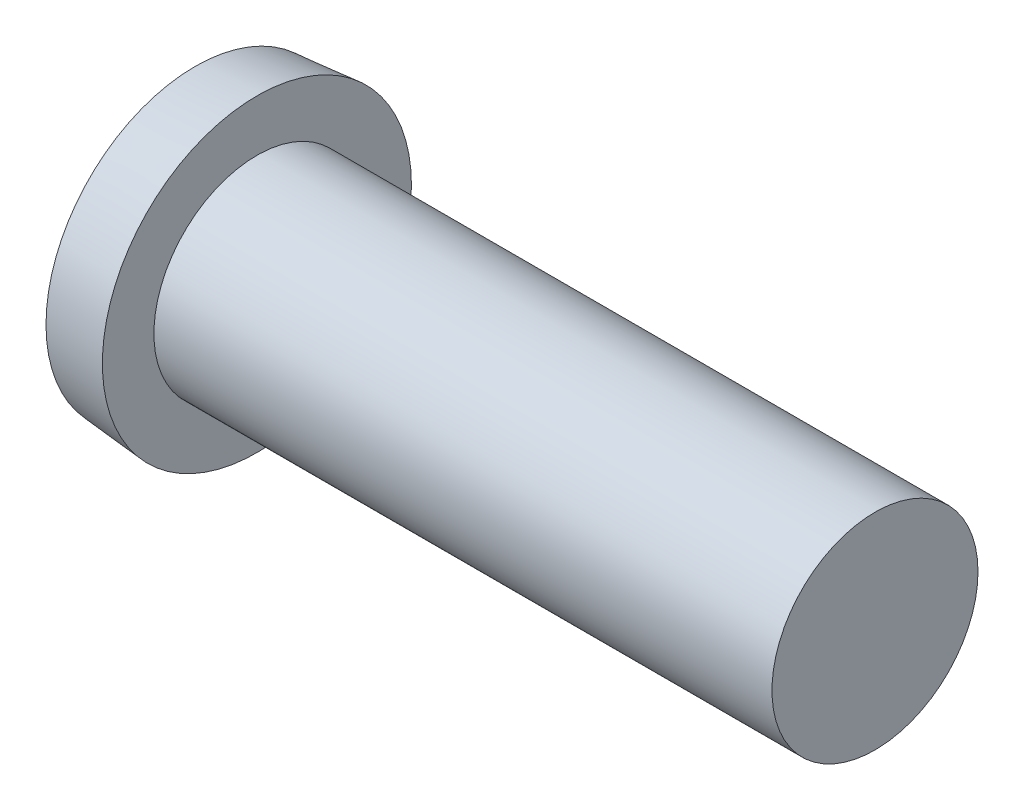
ISO-10303-21;
HEADER;
FILE_DESCRIPTION(('STEP AP214'),'2;1');
FILE_NAME('part.step','',(''),(''),'','','');
FILE_SCHEMA(('AUTOMOTIVE_DESIGN { 1 0 10303 214 1 1 1 1 }'));
ENDSEC;
DATA;
#1=APPLICATION_CONTEXT('core data for automotive mechanical design processes');
#2=APPLICATION_PROTOCOL_DEFINITION('international standard','automotive_design',2000,#1);
#3=PRODUCT_CONTEXT('',#1,'mechanical');
#4=PRODUCT('Part','Part','',(#3));
#5=PRODUCT_RELATED_PRODUCT_CATEGORY('part','',(#4));
#6=PRODUCT_DEFINITION_FORMATION('','',#4);
#7=PRODUCT_DEFINITION_CONTEXT('part definition',#1,'design');
#8=PRODUCT_DEFINITION('design','',#6,#7);
#9=PRODUCT_DEFINITION_SHAPE('','',#8);
#10=(LENGTH_UNIT() NAMED_UNIT(*) SI_UNIT(.MILLI.,.METRE.));
#11=(NAMED_UNIT(*) PLANE_ANGLE_UNIT() SI_UNIT($,.RADIAN.));
#12=(NAMED_UNIT(*) SI_UNIT($,.STERADIAN.) SOLID_ANGLE_UNIT());
#13=UNCERTAINTY_MEASURE_WITH_UNIT(LENGTH_MEASURE(1.E-05),#10,'distance_accuracy_value','');
#14=(GEOMETRIC_REPRESENTATION_CONTEXT(3) GLOBAL_UNCERTAINTY_ASSIGNED_CONTEXT((#13)) GLOBAL_UNIT_ASSIGNED_CONTEXT((#10,
#11,#12)) REPRESENTATION_CONTEXT('',''));
#15=CARTESIAN_POINT('',(0.,0.,0.));
#16=DIRECTION('',(0.,0.,1.));
#17=DIRECTION('',(1.,0.,0.));
#18=AXIS2_PLACEMENT_3D('',#15,#16,#17);
#19=CARTESIAN_POINT('',(-0.3,0.,0.));
#20=DIRECTION('',(-1.,0.,0.));
#21=DIRECTION('',(0.,0.,1.));
#22=AXIS2_PLACEMENT_3D('',#19,#20,#21);
#23=PLANE('',#22);
#24=CARTESIAN_POINT('',(-0.3,0.,0.));
#25=DIRECTION('',(-1.,0.,0.));
#26=DIRECTION('',(0.,0.,1.));
#27=AXIS2_PLACEMENT_3D('',#24,#25,#26);
#28=CIRCLE('',#27,1.0000000000332);
#29=CARTESIAN_POINT('',(-0.3,-0.300000000000698,0.953939201451525));
#30=VERTEX_POINT('',#29);
#31=CARTESIAN_POINT('',(-0.3,0.3,0.953939201451589));
#32=VERTEX_POINT('',#31);
#33=EDGE_CURVE('E137',#30,#32,#28,.T.);
#34=ORIENTED_EDGE('',*,*,#33,.T.);
#35=DIRECTION('',(0.,0.,-1.));
#36=VECTOR('',#35,1.);
#37=CARTESIAN_POINT('',(-0.3,0.3,0.));
#38=LINE('',#37,#36);
#39=CARTESIAN_POINT('',(-0.3,0.3,0.3));
#40=VERTEX_POINT('',#39);
#41=EDGE_CURVE('E117',#40,#32,#38,.F.);
#42=ORIENTED_EDGE('',*,*,#41,.F.);
#43=DIRECTION('',(0.,1.,0.));
#44=VECTOR('',#43,1.);
#45=CARTESIAN_POINT('',(-0.3,0.,0.3));
#46=LINE('',#45,#44);
#47=CARTESIAN_POINT('',(-0.3,0.953939201451357,0.3));
#48=VERTEX_POINT('',#47);
#49=EDGE_CURVE('E115',#48,#40,#46,.F.);
#50=ORIENTED_EDGE('',*,*,#49,.F.);
#51=CARTESIAN_POINT('',(-0.3,0.,0.));
#52=DIRECTION('',(-1.,0.,0.));
#53=DIRECTION('',(0.,0.,1.));
#54=AXIS2_PLACEMENT_3D('',#51,#52,#53);
#55=CIRCLE('',#54,1.0000000000332);
#56=CARTESIAN_POINT('',(-0.3,0.953939201451569,-0.3));
#57=VERTEX_POINT('',#56);
#58=EDGE_CURVE('E20',#48,#57,#55,.T.);
#59=ORIENTED_EDGE('',*,*,#58,.T.);
#60=DIRECTION('',(0.,1.,0.));
#61=VECTOR('',#60,1.);
#62=CARTESIAN_POINT('',(-0.3,0.,-0.3));
#63=LINE('',#62,#61);
#64=CARTESIAN_POINT('',(-0.3,0.3,-0.3));
#65=VERTEX_POINT('',#64);
#66=EDGE_CURVE('E113',#65,#57,#63,.T.);
#67=ORIENTED_EDGE('',*,*,#66,.F.);
#68=DIRECTION('',(0.,0.,-1.));
#69=VECTOR('',#68,1.);
#70=CARTESIAN_POINT('',(-0.3,0.3,0.));
#71=LINE('',#70,#69);
#72=CARTESIAN_POINT('',(-0.3,0.300000000001235,-0.953939201451357));
#73=VERTEX_POINT('',#72);
#74=EDGE_CURVE('E165',#73,#65,#71,.F.);
#75=ORIENTED_EDGE('',*,*,#74,.F.);
#76=CARTESIAN_POINT('',(-0.3,0.,0.));
#77=DIRECTION('',(-1.,0.,0.));
#78=DIRECTION('',(0.,0.,1.));
#79=AXIS2_PLACEMENT_3D('',#76,#77,#78);
#80=CIRCLE('',#79,1.0000000000332);
#81=CARTESIAN_POINT('',(-0.3,-0.3,-0.953939201451526));
#82=VERTEX_POINT('',#81);
#83=EDGE_CURVE('E161',#73,#82,#80,.T.);
#84=ORIENTED_EDGE('',*,*,#83,.T.);
#85=DIRECTION('',(0.,0.,1.));
#86=VECTOR('',#85,1.);
#87=CARTESIAN_POINT('',(-0.3,-0.3,0.));
#88=LINE('',#87,#86);
#89=CARTESIAN_POINT('',(-0.3,-0.3,-0.3));
#90=VERTEX_POINT('',#89);
#91=EDGE_CURVE('E157',#90,#82,#88,.F.);
#92=ORIENTED_EDGE('',*,*,#91,.F.);
#93=DIRECTION('',(0.,1.,0.));
#94=VECTOR('',#93,1.);
#95=CARTESIAN_POINT('',(-0.3,0.,-0.3));
#96=LINE('',#95,#94);
#97=CARTESIAN_POINT('',(-0.3,-0.953939201451526,-0.300000000000698));
#98=VERTEX_POINT('',#97);
#99=EDGE_CURVE('E153',#98,#90,#96,.T.);
#100=ORIENTED_EDGE('',*,*,#99,.F.);
#101=CARTESIAN_POINT('',(-0.3,0.,0.));
#102=DIRECTION('',(-1.,0.,0.));
#103=DIRECTION('',(0.,0.,1.));
#104=AXIS2_PLACEMENT_3D('',#101,#102,#103);
#105=CIRCLE('',#104,1.0000000000332);
#106=CARTESIAN_POINT('',(-0.3,-0.953939201451525,0.3));
#107=VERTEX_POINT('',#106);
#108=EDGE_CURVE('E149',#98,#107,#105,.T.);
#109=ORIENTED_EDGE('',*,*,#108,.T.);
#110=DIRECTION('',(0.,1.,0.));
#111=VECTOR('',#110,1.);
#112=CARTESIAN_POINT('',(-0.3,0.,0.3));
#113=LINE('',#112,#111);
#114=CARTESIAN_POINT('',(-0.3,-0.3,0.3));
#115=VERTEX_POINT('',#114);
#116=EDGE_CURVE('E145',#115,#107,#113,.F.);
#117=ORIENTED_EDGE('',*,*,#116,.F.);
#118=DIRECTION('',(0.,0.,1.));
#119=VECTOR('',#118,1.);
#120=CARTESIAN_POINT('',(-0.3,-0.3,0.));
#121=LINE('',#120,#119);
#122=EDGE_CURVE('E141',#30,#115,#121,.F.);
#123=ORIENTED_EDGE('',*,*,#122,.F.);
#124=EDGE_LOOP('',(#34,#42,#50,#59,#67,#75,#84,#92,#100,#109,#117,#123));
#125=FACE_BOUND('',#124,.T.);
#126=ADVANCED_FACE('F17',(#125),#23,.T.);
#127=CARTESIAN_POINT('',(-0.3,0.,0.));
#128=DIRECTION('',(-1.,0.,0.));
#129=DIRECTION('',(0.,0.,1.));
#130=AXIS2_PLACEMENT_3D('',#127,#128,#129);
#131=CYLINDRICAL_SURFACE('',#130,1.0000000000332);
#132=DIRECTION('',(1.,0.,0.));
#133=VECTOR('',#132,1.);
#134=CARTESIAN_POINT('',(-0.3,0.953939201451393,-0.3));
#135=LINE('',#134,#133);
#136=CARTESIAN_POINT('',(-0.6,0.953939201451393,-0.30000000000056));
#137=VERTEX_POINT('',#136);
#138=EDGE_CURVE('E110',#57,#137,#135,.F.);
#139=ORIENTED_EDGE('',*,*,#138,.F.);
#140=ORIENTED_EDGE('',*,*,#58,.F.);
#141=DIRECTION('',(-1.,0.,0.));
#142=VECTOR('',#141,1.);
#143=CARTESIAN_POINT('',(-0.3,0.953939201450969,0.3));
#144=LINE('',#143,#142);
#145=CARTESIAN_POINT('',(-0.6,0.953939201451357,0.3));
#146=VERTEX_POINT('',#145);
#147=EDGE_CURVE('E107',#146,#48,#144,.F.);
#148=ORIENTED_EDGE('',*,*,#147,.F.);
#149=CARTESIAN_POINT('',(-0.6,0.,0.));
#150=DIRECTION('',(-1.,0.,0.));
#151=DIRECTION('',(0.,0.,1.));
#152=AXIS2_PLACEMENT_3D('',#149,#150,#151);
#153=CIRCLE('',#152,1.0000000000332);
#154=EDGE_CURVE('E132',#146,#137,#153,.T.);
#155=ORIENTED_EDGE('',*,*,#154,.T.);
#156=EDGE_LOOP('',(#139,#140,#148,#155));
#157=FACE_BOUND('',#156,.T.);
#158=ADVANCED_FACE('F105',(#157),#131,.F.);
#159=CARTESIAN_POINT('',(-0.3,0.,-0.3));
#160=DIRECTION('',(0.,0.,1.));
#161=DIRECTION('',(1.,0.,0.));
#162=AXIS2_PLACEMENT_3D('',#159,#160,#161);
#163=PLANE('',#162);
#164=ORIENTED_EDGE('',*,*,#66,.T.);
#165=ORIENTED_EDGE('',*,*,#138,.T.);
#166=DIRECTION('',(0.,1.,0.));
#167=VECTOR('',#166,1.);
#168=CARTESIAN_POINT('',(-0.6,0.,-0.300000000001121));
#169=LINE('',#168,#167);
#170=CARTESIAN_POINT('',(-0.6,0.3,-0.300000000000747));
#171=VERTEX_POINT('',#170);
#172=EDGE_CURVE('E130',#137,#171,#169,.F.);
#173=ORIENTED_EDGE('',*,*,#172,.T.);
#174=DIRECTION('',(1.,0.,0.));
#175=VECTOR('',#174,1.);
#176=CARTESIAN_POINT('',(-0.3,0.3,-0.3));
#177=LINE('',#176,#175);
#178=EDGE_CURVE('E162',#65,#171,#177,.F.);
#179=ORIENTED_EDGE('',*,*,#178,.F.);
#180=EDGE_LOOP('',(#164,#165,#173,#179));
#181=FACE_BOUND('',#180,.T.);
#182=ADVANCED_FACE('F247',(#181),#163,.T.);
#183=CARTESIAN_POINT('',(-0.3,0.3,0.));
#184=DIRECTION('',(0.,-1.,0.));
#185=DIRECTION('',(0.,0.,-1.));
#186=AXIS2_PLACEMENT_3D('',#183,#184,#185);
#187=PLANE('',#186);
#188=ORIENTED_EDGE('',*,*,#74,.T.);
#189=ORIENTED_EDGE('',*,*,#178,.T.);
#190=DIRECTION('',(0.,0.,-1.));
#191=VECTOR('',#190,1.);
#192=CARTESIAN_POINT('',(-0.6,0.3,0.));
#193=LINE('',#192,#191);
#194=CARTESIAN_POINT('',(-0.6,0.300000000001235,-0.953939201451357));
#195=VERTEX_POINT('',#194);
#196=EDGE_CURVE('E197',#171,#195,#193,.T.);
#197=ORIENTED_EDGE('',*,*,#196,.T.);
#198=DIRECTION('',(-1.,0.,0.));
#199=VECTOR('',#198,1.);
#200=CARTESIAN_POINT('',(-0.3,0.300000000002469,-0.953939201450969));
#201=LINE('',#200,#199);
#202=EDGE_CURVE('E158',#195,#73,#201,.F.);
#203=ORIENTED_EDGE('',*,*,#202,.T.);
#204=EDGE_LOOP('',(#188,#189,#197,#203));
#205=FACE_BOUND('',#204,.T.);
#206=ADVANCED_FACE('F248',(#205),#187,.T.);
#207=CARTESIAN_POINT('',(-0.3,0.,0.));
#208=DIRECTION('',(-1.,0.,0.));
#209=DIRECTION('',(0.,0.,1.));
#210=AXIS2_PLACEMENT_3D('',#207,#208,#209);
#211=CYLINDRICAL_SURFACE('',#210,1.0000000000332);
#212=DIRECTION('',(1.,0.,0.));
#213=VECTOR('',#212,1.);
#214=CARTESIAN_POINT('',(-0.3,-0.3,-0.953939201451306));
#215=LINE('',#214,#213);
#216=CARTESIAN_POINT('',(-0.6,-0.300000000000698,-0.953939201451306));
#217=VERTEX_POINT('',#216);
#218=EDGE_CURVE('E154',#82,#217,#215,.F.);
#219=ORIENTED_EDGE('',*,*,#218,.F.);
#220=ORIENTED_EDGE('',*,*,#83,.F.);
#221=ORIENTED_EDGE('',*,*,#202,.F.);
#222=CARTESIAN_POINT('',(-0.6,0.,0.));
#223=DIRECTION('',(-1.,0.,0.));
#224=DIRECTION('',(0.,0.,1.));
#225=AXIS2_PLACEMENT_3D('',#222,#223,#224);
#226=CIRCLE('',#225,1.0000000000332);
#227=EDGE_CURVE('E194',#195,#217,#226,.T.);
#228=ORIENTED_EDGE('',*,*,#227,.T.);
#229=EDGE_LOOP('',(#219,#220,#221,#228));
#230=FACE_BOUND('',#229,.T.);
#231=ADVANCED_FACE('F205',(#230),#211,.F.);
#232=CARTESIAN_POINT('',(-0.3,-0.3,0.));
#233=DIRECTION('',(0.,1.,0.));
#234=DIRECTION('',(0.,0.,1.));
#235=AXIS2_PLACEMENT_3D('',#232,#233,#234);
#236=PLANE('',#235);
#237=ORIENTED_EDGE('',*,*,#91,.T.);
#238=ORIENTED_EDGE('',*,*,#218,.T.);
#239=DIRECTION('',(0.,0.,-1.));
#240=VECTOR('',#239,1.);
#241=CARTESIAN_POINT('',(-0.6,-0.300000000001397,0.));
#242=LINE('',#241,#240);
#243=CARTESIAN_POINT('',(-0.6,-0.300000000000931,-0.3));
#244=VERTEX_POINT('',#243);
#245=EDGE_CURVE('E196',#217,#244,#242,.F.);
#246=ORIENTED_EDGE('',*,*,#245,.T.);
#247=DIRECTION('',(1.,0.,0.));
#248=VECTOR('',#247,1.);
#249=CARTESIAN_POINT('',(-0.3,-0.3,-0.3));
#250=LINE('',#249,#248);
#251=EDGE_CURVE('E150',#90,#244,#250,.F.);
#252=ORIENTED_EDGE('',*,*,#251,.F.);
#253=EDGE_LOOP('',(#237,#238,#246,#252));
#254=FACE_BOUND('',#253,.T.);
#255=ADVANCED_FACE('F209',(#254),#236,.T.);
#256=CARTESIAN_POINT('',(-0.3,0.,-0.3));
#257=DIRECTION('',(0.,0.,1.));
#258=DIRECTION('',(1.,0.,0.));
#259=AXIS2_PLACEMENT_3D('',#256,#257,#258);
#260=PLANE('',#259);
#261=ORIENTED_EDGE('',*,*,#99,.T.);
#262=ORIENTED_EDGE('',*,*,#251,.T.);
#263=DIRECTION('',(0.,1.,0.));
#264=VECTOR('',#263,1.);
#265=CARTESIAN_POINT('',(-0.6,0.,-0.3));
#266=LINE('',#265,#264);
#267=CARTESIAN_POINT('',(-0.6,-0.953939201451526,-0.300000000000698));
#268=VERTEX_POINT('',#267);
#269=EDGE_CURVE('E193',#244,#268,#266,.F.);
#270=ORIENTED_EDGE('',*,*,#269,.T.);
#271=DIRECTION('',(-1.,0.,0.));
#272=VECTOR('',#271,1.);
#273=CARTESIAN_POINT('',(-0.3,-0.953939201451306,-0.300000000001397));
#274=LINE('',#273,#272);
#275=EDGE_CURVE('E146',#268,#98,#274,.F.);
#276=ORIENTED_EDGE('',*,*,#275,.T.);
#277=EDGE_LOOP('',(#261,#262,#270,#276));
#278=FACE_BOUND('',#277,.T.);
#279=ADVANCED_FACE('F212',(#278),#260,.T.);
#280=CARTESIAN_POINT('',(-0.3,0.,0.));
#281=DIRECTION('',(-1.,0.,0.));
#282=DIRECTION('',(0.,0.,1.));
#283=AXIS2_PLACEMENT_3D('',#280,#281,#282);
#284=CYLINDRICAL_SURFACE('',#283,1.0000000000332);
#285=DIRECTION('',(-1.,0.,0.));
#286=VECTOR('',#285,1.);
#287=CARTESIAN_POINT('',(-0.3,-0.953939201451306,0.3));
#288=LINE('',#287,#286);
#289=CARTESIAN_POINT('',(-0.6,-0.953939201451306,0.300000000000698));
#290=VERTEX_POINT('',#289);
#291=EDGE_CURVE('E142',#107,#290,#288,.T.);
#292=ORIENTED_EDGE('',*,*,#291,.F.);
#293=ORIENTED_EDGE('',*,*,#108,.F.);
#294=ORIENTED_EDGE('',*,*,#275,.F.);
#295=CARTESIAN_POINT('',(-0.6,0.,0.));
#296=DIRECTION('',(-1.,0.,0.));
#297=DIRECTION('',(0.,0.,1.));
#298=AXIS2_PLACEMENT_3D('',#295,#296,#297);
#299=CIRCLE('',#298,1.0000000000332);
#300=EDGE_CURVE('E190',#268,#290,#299,.T.);
#301=ORIENTED_EDGE('',*,*,#300,.T.);
#302=EDGE_LOOP('',(#292,#293,#294,#301));
#303=FACE_BOUND('',#302,.T.);
#304=ADVANCED_FACE('F219',(#303),#284,.F.);
#305=CARTESIAN_POINT('',(-0.3,0.,0.3));
#306=DIRECTION('',(0.,0.,-1.));
#307=DIRECTION('',(-1.,0.,0.));
#308=AXIS2_PLACEMENT_3D('',#305,#306,#307);
#309=PLANE('',#308);
#310=ORIENTED_EDGE('',*,*,#116,.T.);
#311=ORIENTED_EDGE('',*,*,#291,.T.);
#312=DIRECTION('',(0.,1.,0.));
#313=VECTOR('',#312,1.);
#314=CARTESIAN_POINT('',(-0.6,0.,0.300000000001397));
#315=LINE('',#314,#313);
#316=CARTESIAN_POINT('',(-0.6,-0.3,0.300000000000931));
#317=VERTEX_POINT('',#316);
#318=EDGE_CURVE('E192',#290,#317,#315,.T.);
#319=ORIENTED_EDGE('',*,*,#318,.T.);
#320=DIRECTION('',(1.,0.,0.));
#321=VECTOR('',#320,1.);
#322=CARTESIAN_POINT('',(-0.3,-0.3,0.3));
#323=LINE('',#322,#321);
#324=EDGE_CURVE('E138',#115,#317,#323,.F.);
#325=ORIENTED_EDGE('',*,*,#324,.F.);
#326=EDGE_LOOP('',(#310,#311,#319,#325));
#327=FACE_BOUND('',#326,.T.);
#328=ADVANCED_FACE('F223',(#327),#309,.T.);
#329=CARTESIAN_POINT('',(-0.3,-0.3,0.));
#330=DIRECTION('',(0.,1.,0.));
#331=DIRECTION('',(0.,0.,1.));
#332=AXIS2_PLACEMENT_3D('',#329,#330,#331);
#333=PLANE('',#332);
#334=ORIENTED_EDGE('',*,*,#122,.T.);
#335=ORIENTED_EDGE('',*,*,#324,.T.);
#336=DIRECTION('',(0.,0.,-1.));
#337=VECTOR('',#336,1.);
#338=CARTESIAN_POINT('',(-0.6,-0.3,0.));
#339=LINE('',#338,#337);
#340=CARTESIAN_POINT('',(-0.6,-0.300000000000698,0.953939201451525));
#341=VERTEX_POINT('',#340);
#342=EDGE_CURVE('E189',#317,#341,#339,.F.);
#343=ORIENTED_EDGE('',*,*,#342,.T.);
#344=DIRECTION('',(-1.,0.,0.));
#345=VECTOR('',#344,1.);
#346=CARTESIAN_POINT('',(-0.3,-0.300000000001397,0.953939201451306));
#347=LINE('',#346,#345);
#348=EDGE_CURVE('E134',#341,#30,#347,.F.);
#349=ORIENTED_EDGE('',*,*,#348,.T.);
#350=EDGE_LOOP('',(#334,#335,#343,#349));
#351=FACE_BOUND('',#350,.T.);
#352=ADVANCED_FACE('F227',(#351),#333,.T.);
#353=CARTESIAN_POINT('',(-0.3,0.,0.));
#354=DIRECTION('',(-1.,0.,0.));
#355=DIRECTION('',(0.,0.,1.));
#356=AXIS2_PLACEMENT_3D('',#353,#354,#355);
#357=CYLINDRICAL_SURFACE('',#356,1.0000000000332);
#358=ORIENTED_EDGE('',*,*,#33,.F.);
#359=ORIENTED_EDGE('',*,*,#348,.F.);
#360=CARTESIAN_POINT('',(-0.6,0.,0.));
#361=DIRECTION('',(-1.,0.,0.));
#362=DIRECTION('',(0.,0.,1.));
#363=AXIS2_PLACEMENT_3D('',#360,#361,#362);
#364=CIRCLE('',#363,1.0000000000332);
#365=CARTESIAN_POINT('',(-0.6,0.300000000000495,0.953939201451433));
#366=VERTEX_POINT('',#365);
#367=EDGE_CURVE('E187',#341,#366,#364,.T.);
#368=ORIENTED_EDGE('',*,*,#367,.T.);
#369=DIRECTION('',(1.,0.,0.));
#370=VECTOR('',#369,1.);
#371=CARTESIAN_POINT('',(-0.3,0.3,0.953939201451433));
#372=LINE('',#371,#370);
#373=EDGE_CURVE('E125',#32,#366,#372,.F.);
#374=ORIENTED_EDGE('',*,*,#373,.F.);
#375=EDGE_LOOP('',(#358,#359,#368,#374));
#376=FACE_BOUND('',#375,.T.);
#377=ADVANCED_FACE('F231',(#376),#357,.F.);
#378=CARTESIAN_POINT('',(-0.3,0.3,0.));
#379=DIRECTION('',(0.,-1.,0.));
#380=DIRECTION('',(0.,0.,-1.));
#381=AXIS2_PLACEMENT_3D('',#378,#379,#380);
#382=PLANE('',#381);
#383=ORIENTED_EDGE('',*,*,#41,.T.);
#384=ORIENTED_EDGE('',*,*,#373,.T.);
#385=DIRECTION('',(0.,0.,-1.));
#386=VECTOR('',#385,1.);
#387=CARTESIAN_POINT('',(-0.6,0.300000000000991,0.));
#388=LINE('',#387,#386);
#389=CARTESIAN_POINT('',(-0.6,0.300000000000661,0.3));
#390=VERTEX_POINT('',#389);
#391=EDGE_CURVE('E35',#366,#390,#388,.T.);
#392=ORIENTED_EDGE('',*,*,#391,.T.);
#393=DIRECTION('',(-1.,0.,0.));
#394=VECTOR('',#393,1.);
#395=CARTESIAN_POINT('',(-0.3,0.3,0.3));
#396=LINE('',#395,#394);
#397=EDGE_CURVE('E119',#40,#390,#396,.T.);
#398=ORIENTED_EDGE('',*,*,#397,.F.);
#399=EDGE_LOOP('',(#383,#384,#392,#398));
#400=FACE_BOUND('',#399,.T.);
#401=ADVANCED_FACE('F232',(#400),#382,.T.);
#402=CARTESIAN_POINT('',(-0.3,0.,0.3));
#403=DIRECTION('',(0.,0.,-1.));
#404=DIRECTION('',(-1.,0.,0.));
#405=AXIS2_PLACEMENT_3D('',#402,#403,#404);
#406=PLANE('',#405);
#407=ORIENTED_EDGE('',*,*,#49,.T.);
#408=ORIENTED_EDGE('',*,*,#397,.T.);
#409=DIRECTION('',(0.,1.,0.));
#410=VECTOR('',#409,1.);
#411=CARTESIAN_POINT('',(-0.6,0.,0.3));
#412=LINE('',#411,#410);
#413=EDGE_CURVE('E123',#390,#146,#412,.T.);
#414=ORIENTED_EDGE('',*,*,#413,.T.);
#415=ORIENTED_EDGE('',*,*,#147,.T.);
#416=EDGE_LOOP('',(#407,#408,#414,#415));
#417=FACE_BOUND('',#416,.T.);
#418=ADVANCED_FACE('F121',(#417),#406,.T.);
#419=CARTESIAN_POINT('',(-0.6,0.,0.));
#420=DIRECTION('',(1.,0.,0.));
#421=DIRECTION('',(0.,0.,-1.));
#422=AXIS2_PLACEMENT_3D('',#419,#420,#421);
#423=PLANE('',#422);
#424=ORIENTED_EDGE('',*,*,#391,.F.);
#425=ORIENTED_EDGE('',*,*,#367,.F.);
#426=ORIENTED_EDGE('',*,*,#342,.F.);
#427=ORIENTED_EDGE('',*,*,#318,.F.);
#428=ORIENTED_EDGE('',*,*,#300,.F.);
#429=ORIENTED_EDGE('',*,*,#269,.F.);
#430=ORIENTED_EDGE('',*,*,#245,.F.);
#431=ORIENTED_EDGE('',*,*,#227,.F.);
#432=ORIENTED_EDGE('',*,*,#196,.F.);
#433=ORIENTED_EDGE('',*,*,#172,.F.);
#434=ORIENTED_EDGE('',*,*,#154,.F.);
#435=ORIENTED_EDGE('',*,*,#413,.F.);
#436=EDGE_LOOP('',(#424,#425,#426,#427,#428,#429,#430,#431,#432,#433,#434,#435));
#437=FACE_BOUND('',#436,.T.);
#438=CARTESIAN_POINT('',(-0.600000000019918,0.,0.));
#439=DIRECTION('',(1.,0.,0.));
#440=DIRECTION('',(0.,0.,-1.));
#441=AXIS2_PLACEMENT_3D('',#438,#439,#440);
#442=CIRCLE('',#441,1.44750680187897);
#443=CARTESIAN_POINT('',(-0.600000000019918,0.,-1.44750680187897));
#444=VERTEX_POINT('',#443);
#445=EDGE_CURVE('E184',#444,#444,#442,.T.);
#446=ORIENTED_EDGE('',*,*,#445,.F.);
#447=EDGE_LOOP('',(#446));
#448=FACE_BOUND('',#447,.T.);
#449=ADVANCED_FACE('F234',(#437,#448),#423,.F.);
#450=CARTESIAN_POINT('',(-1.13686837721616E-10,0.,0.));
#451=DIRECTION('',(1.,0.,0.));
#452=DIRECTION('',(0.,0.,-1.));
#453=AXIS2_PLACEMENT_3D('',#450,#451,#452);
#454=CONICAL_SURFACE('',#453,1.49999999998585,0.0872664625989279);
#455=ORIENTED_EDGE('',*,*,#445,.T.);
#456=EDGE_LOOP('',(#455));
#457=FACE_BOUND('',#456,.T.);
#458=CARTESIAN_POINT('',(0.,0.,0.));
#459=DIRECTION('',(1.,0.,0.));
#460=DIRECTION('',(0.,0.,-1.));
#461=AXIS2_PLACEMENT_3D('',#458,#459,#460);
#462=CIRCLE('',#461,1.49999999999579);
#463=CARTESIAN_POINT('',(0.,0.,-1.49999999999579));
#464=VERTEX_POINT('',#463);
#465=EDGE_CURVE('E181',#464,#464,#462,.F.);
#466=ORIENTED_EDGE('',*,*,#465,.T.);
#467=EDGE_LOOP('',(#466));
#468=FACE_BOUND('',#467,.T.);
#469=ADVANCED_FACE('F273',(#457,#468),#454,.T.);
#470=CARTESIAN_POINT('',(0.,1.5,0.));
#471=DIRECTION('',(-1.,0.,0.));
#472=DIRECTION('',(0.,0.,1.));
#473=AXIS2_PLACEMENT_3D('',#470,#471,#472);
#474=PLANE('',#473);
#475=ORIENTED_EDGE('',*,*,#465,.F.);
#476=EDGE_LOOP('',(#475));
#477=FACE_BOUND('',#476,.T.);
#478=CARTESIAN_POINT('',(0.,0.,0.));
#479=DIRECTION('',(1.,0.,0.));
#480=DIRECTION('',(0.,0.,-1.));
#481=AXIS2_PLACEMENT_3D('',#478,#479,#480);
#482=CIRCLE('',#481,1.);
#483=CARTESIAN_POINT('',(0.,0.,-1.));
#484=VERTEX_POINT('',#483);
#485=EDGE_CURVE('E26',#484,#484,#482,.T.);
#486=ORIENTED_EDGE('',*,*,#485,.F.);
#487=EDGE_LOOP('',(#486));
#488=FACE_BOUND('',#487,.T.);
#489=ADVANCED_FACE('F266',(#477,#488),#474,.F.);
#490=CARTESIAN_POINT('',(6.,0.,0.));
#491=DIRECTION('',(1.,0.,0.));
#492=DIRECTION('',(0.,0.,-1.));
#493=AXIS2_PLACEMENT_3D('',#490,#491,#492);
#494=PLANE('',#493);
#495=CARTESIAN_POINT('',(6.,0.,0.));
#496=DIRECTION('',(1.,0.,0.));
#497=DIRECTION('',(0.,0.,-1.));
#498=AXIS2_PLACEMENT_3D('',#495,#496,#497);
#499=CIRCLE('',#498,1.);
#500=CARTESIAN_POINT('',(6.,0.,-1.));
#501=VERTEX_POINT('',#500);
#502=EDGE_CURVE('E10',#501,#501,#499,.F.);
#503=ORIENTED_EDGE('',*,*,#502,.F.);
#504=EDGE_LOOP('',(#503));
#505=FACE_BOUND('',#504,.T.);
#506=ADVANCED_FACE('F260',(#505),#494,.T.);
#507=CARTESIAN_POINT('',(6.,0.,0.));
#508=DIRECTION('',(1.,0.,0.));
#509=DIRECTION('',(0.,0.,-1.));
#510=AXIS2_PLACEMENT_3D('',#507,#508,#509);
#511=CYLINDRICAL_SURFACE('',#510,1.);
#512=ORIENTED_EDGE('',*,*,#502,.T.);
#513=EDGE_LOOP('',(#512));
#514=FACE_BOUND('',#513,.T.);
#515=ORIENTED_EDGE('',*,*,#485,.T.);
#516=EDGE_LOOP('',(#515));
#517=FACE_BOUND('',#516,.T.);
#518=ADVANCED_FACE('F258',(#514,#517),#511,.T.);
#519=CLOSED_SHELL('',(#126,#158,#182,#206,#231,#255,#279,#304,#328,#352,#377,#401,#418,#449,
#469,#489,#506,#518));
#520=MANIFOLD_SOLID_BREP('B1',#519);
#521=ADVANCED_BREP_SHAPE_REPRESENTATION('',(#18,#520),#14);
#522=SHAPE_DEFINITION_REPRESENTATION(#9,#521);
ENDSEC;
END-ISO-10303-21;
